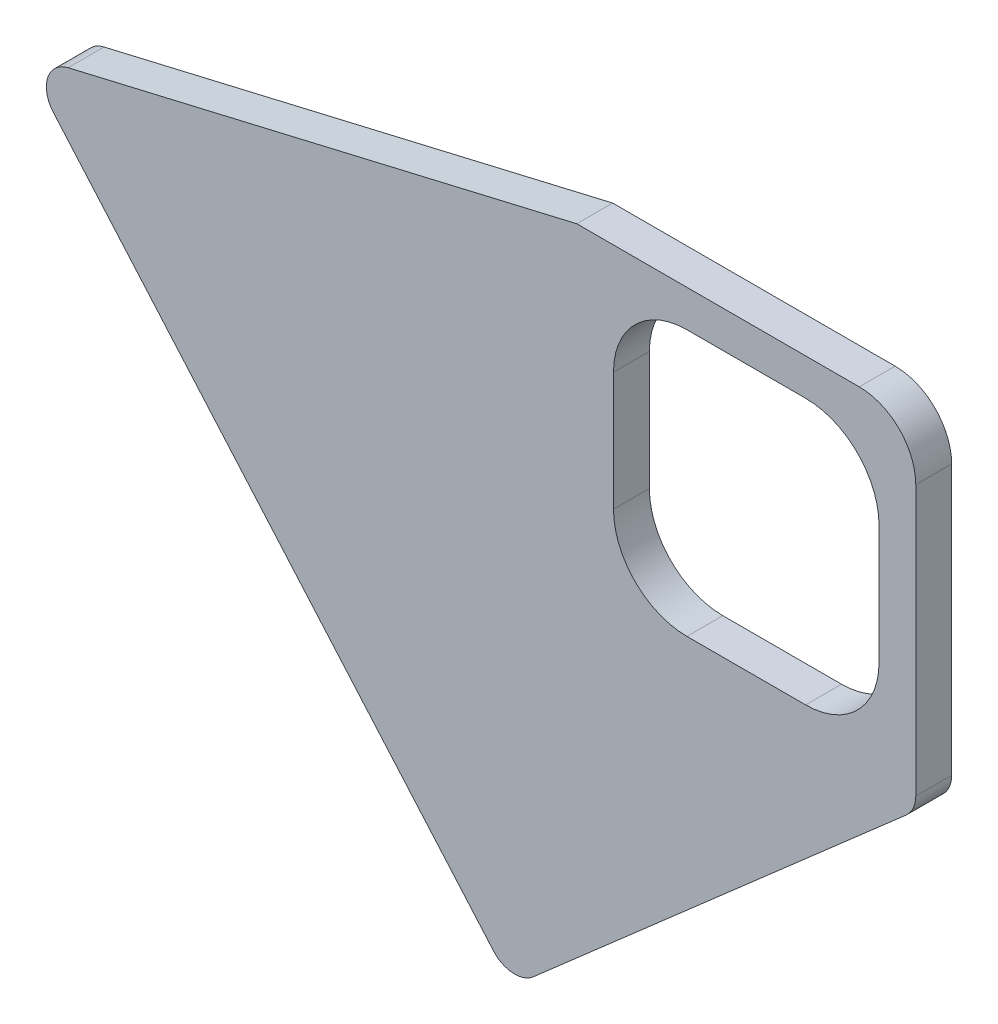
ISO-10303-21;
HEADER;
FILE_DESCRIPTION(('STEP AP214'),'2;1');
FILE_NAME('part.step','',(''),(''),'','','');
FILE_SCHEMA(('AUTOMOTIVE_DESIGN { 1 0 10303 214 1 1 1 1 }'));
ENDSEC;
DATA;
#1=APPLICATION_CONTEXT('core data for automotive mechanical design processes');
#2=APPLICATION_PROTOCOL_DEFINITION('international standard','automotive_design',2000,#1);
#3=PRODUCT_CONTEXT('',#1,'mechanical');
#4=PRODUCT('Part','Part','',(#3));
#5=PRODUCT_RELATED_PRODUCT_CATEGORY('part','',(#4));
#6=PRODUCT_DEFINITION_FORMATION('','',#4);
#7=PRODUCT_DEFINITION_CONTEXT('part definition',#1,'design');
#8=PRODUCT_DEFINITION('design','',#6,#7);
#9=PRODUCT_DEFINITION_SHAPE('','',#8);
#10=(LENGTH_UNIT() NAMED_UNIT(*) SI_UNIT(.MILLI.,.METRE.));
#11=(NAMED_UNIT(*) PLANE_ANGLE_UNIT() SI_UNIT($,.RADIAN.));
#12=(NAMED_UNIT(*) SI_UNIT($,.STERADIAN.) SOLID_ANGLE_UNIT());
#13=UNCERTAINTY_MEASURE_WITH_UNIT(LENGTH_MEASURE(1.E-05),#10,'distance_accuracy_value','');
#14=(GEOMETRIC_REPRESENTATION_CONTEXT(3) GLOBAL_UNCERTAINTY_ASSIGNED_CONTEXT((#13)) GLOBAL_UNIT_ASSIGNED_CONTEXT((#10,
#11,#12)) REPRESENTATION_CONTEXT('',''));
#15=CARTESIAN_POINT('',(0.,0.,0.));
#16=DIRECTION('',(0.,0.,1.));
#17=DIRECTION('',(1.,0.,0.));
#18=AXIS2_PLACEMENT_3D('',#15,#16,#17);
#19=CARTESIAN_POINT('',(-41.4714420605064,-92.5846064922651,6.35));
#20=DIRECTION('',(-0.658785331497527,0.752330969057963,0.));
#21=DIRECTION('',(-0.752330969057963,-0.658785331497527,0.));
#22=AXIS2_PLACEMENT_3D('',#19,#20,#21);
#23=PLANE('',#22);
#24=DIRECTION('',(0.752330969057963,0.658785331497527,0.));
#25=VECTOR('',#24,1.);
#26=CARTESIAN_POINT('',(-41.4714420605064,-92.5846064922651,6.35));
#27=LINE('',#26,#25);
#28=CARTESIAN_POINT('',(-37.6971197494054,-89.2795874552172,6.35));
#29=VERTEX_POINT('',#28);
#30=CARTESIAN_POINT('',(28.2939266574876,-31.4939383578925,6.35));
#31=VERTEX_POINT('',#30);
#32=EDGE_CURVE('E221',#29,#31,#27,.T.);
#33=ORIENTED_EDGE('',*,*,#32,.F.);
#34=DIRECTION('',(0.,0.,-1.));
#35=VECTOR('',#34,1.);
#36=CARTESIAN_POINT('',(-37.6971197494054,-89.2795874552172,6.35));
#37=LINE('',#36,#35);
#38=CARTESIAN_POINT('',(-37.6971197494054,-89.2795874552172,0.));
#39=VERTEX_POINT('',#38);
#40=EDGE_CURVE('E41',#29,#39,#37,.T.);
#41=ORIENTED_EDGE('',*,*,#40,.T.);
#42=DIRECTION('',(0.752330969057963,0.658785331497527,0.));
#43=VECTOR('',#42,1.);
#44=CARTESIAN_POINT('',(-41.4714420605064,-92.5846064922651,0.));
#45=LINE('',#44,#43);
#46=CARTESIAN_POINT('',(28.2939266574876,-31.4939383578925,0.));
#47=VERTEX_POINT('',#46);
#48=EDGE_CURVE('E209',#39,#47,#45,.T.);
#49=ORIENTED_EDGE('',*,*,#48,.T.);
#50=DIRECTION('',(0.,0.,-1.));
#51=VECTOR('',#50,1.);
#52=CARTESIAN_POINT('',(28.2939266574876,-31.4939383578925,6.35));
#53=LINE('',#52,#51);
#54=EDGE_CURVE('E279',#47,#31,#53,.F.);
#55=ORIENTED_EDGE('',*,*,#54,.T.);
#56=EDGE_LOOP('',(#33,#41,#49,#55));
#57=FACE_BOUND('',#56,.T.);
#58=ADVANCED_FACE('F33',(#57),#23,.F.);
#59=CARTESIAN_POINT('',(30.,30.,6.35));
#60=DIRECTION('',(-1.,0.,0.));
#61=DIRECTION('',(0.,-1.,0.));
#62=AXIS2_PLACEMENT_3D('',#59,#60,#61);
#63=PLANE('',#62);
#64=DIRECTION('',(0.,1.,0.));
#65=VECTOR('',#64,1.);
#66=CARTESIAN_POINT('',(30.,30.,6.35));
#67=LINE('',#66,#65);
#68=CARTESIAN_POINT('',(30.,-27.7322835126027,6.35));
#69=VERTEX_POINT('',#68);
#70=CARTESIAN_POINT('',(30.,20.,6.35));
#71=VERTEX_POINT('',#70);
#72=EDGE_CURVE('E224',#69,#71,#67,.T.);
#73=ORIENTED_EDGE('',*,*,#72,.F.);
#74=DIRECTION('',(0.,0.,-1.));
#75=VECTOR('',#74,1.);
#76=CARTESIAN_POINT('',(30.,-27.7322835126027,6.35));
#77=LINE('',#76,#75);
#78=CARTESIAN_POINT('',(30.,-27.7322835126027,0.));
#79=VERTEX_POINT('',#78);
#80=EDGE_CURVE('E11',#69,#79,#77,.T.);
#81=ORIENTED_EDGE('',*,*,#80,.T.);
#82=DIRECTION('',(0.,1.,0.));
#83=VECTOR('',#82,1.);
#84=CARTESIAN_POINT('',(30.,30.,0.));
#85=LINE('',#84,#83);
#86=CARTESIAN_POINT('',(30.,20.,0.));
#87=VERTEX_POINT('',#86);
#88=EDGE_CURVE('E238',#79,#87,#85,.T.);
#89=ORIENTED_EDGE('',*,*,#88,.T.);
#90=DIRECTION('',(0.,0.,-1.));
#91=VECTOR('',#90,1.);
#92=CARTESIAN_POINT('',(30.,20.,6.35));
#93=LINE('',#92,#91);
#94=EDGE_CURVE('E255',#87,#71,#93,.F.);
#95=ORIENTED_EDGE('',*,*,#94,.T.);
#96=EDGE_LOOP('',(#73,#81,#89,#95));
#97=FACE_BOUND('',#96,.T.);
#98=ADVANCED_FACE('F295',(#97),#63,.F.);
#99=CARTESIAN_POINT('',(-30.,30.,6.35));
#100=DIRECTION('',(0.,-1.,0.));
#101=DIRECTION('',(0.,0.,-1.));
#102=AXIS2_PLACEMENT_3D('',#99,#100,#101);
#103=PLANE('',#102);
#104=DIRECTION('',(-1.,0.,0.));
#105=VECTOR('',#104,1.);
#106=CARTESIAN_POINT('',(-30.,30.,6.35));
#107=LINE('',#106,#105);
#108=CARTESIAN_POINT('',(20.,30.,6.35));
#109=VERTEX_POINT('',#108);
#110=CARTESIAN_POINT('',(-30.,30.,6.35));
#111=VERTEX_POINT('',#110);
#112=EDGE_CURVE('E227',#109,#111,#107,.T.);
#113=ORIENTED_EDGE('',*,*,#112,.F.);
#114=DIRECTION('',(0.,0.,-1.));
#115=VECTOR('',#114,1.);
#116=CARTESIAN_POINT('',(20.,30.,6.35));
#117=LINE('',#116,#115);
#118=CARTESIAN_POINT('',(20.,30.,0.));
#119=VERTEX_POINT('',#118);
#120=EDGE_CURVE('E249',#109,#119,#117,.T.);
#121=ORIENTED_EDGE('',*,*,#120,.T.);
#122=DIRECTION('',(-1.,0.,0.));
#123=VECTOR('',#122,1.);
#124=CARTESIAN_POINT('',(-30.,30.,0.));
#125=LINE('',#124,#123);
#126=CARTESIAN_POINT('',(-30.,30.,0.));
#127=VERTEX_POINT('',#126);
#128=EDGE_CURVE('E240',#119,#127,#125,.T.);
#129=ORIENTED_EDGE('',*,*,#128,.T.);
#130=DIRECTION('',(0.,0.,-1.));
#131=VECTOR('',#130,1.);
#132=CARTESIAN_POINT('',(-30.,30.,6.35));
#133=LINE('',#132,#131);
#134=EDGE_CURVE('E235',#111,#127,#133,.T.);
#135=ORIENTED_EDGE('',*,*,#134,.F.);
#136=EDGE_LOOP('',(#113,#121,#129,#135));
#137=FACE_BOUND('',#136,.T.);
#138=ADVANCED_FACE('F319',(#137),#103,.F.);
#139=CARTESIAN_POINT('',(-128.096756389888,7.01486598292345,6.35));
#140=DIRECTION('',(0.228132112939672,-0.973630185977038,0.));
#141=DIRECTION('',(0.973630185977038,0.228132112939672,0.));
#142=AXIS2_PLACEMENT_3D('',#139,#140,#141);
#143=PLANE('',#142);
#144=DIRECTION('',(-0.973630185977038,-0.228132112939672,0.));
#145=VECTOR('',#144,1.);
#146=CARTESIAN_POINT('',(-128.096756389888,7.01486598292345,0.));
#147=LINE('',#146,#145);
#148=CARTESIAN_POINT('',(-120.022341274958,8.90678902254509,0.));
#149=VERTEX_POINT('',#148);
#150=EDGE_CURVE('E242',#127,#149,#147,.T.);
#151=ORIENTED_EDGE('',*,*,#150,.T.);
#152=DIRECTION('',(0.,0.,-1.));
#153=VECTOR('',#152,1.);
#154=CARTESIAN_POINT('',(-120.022341274958,8.90678902254509,6.35));
#155=LINE('',#154,#153);
#156=CARTESIAN_POINT('',(-120.022341274958,8.90678902254509,6.35));
#157=VERTEX_POINT('',#156);
#158=EDGE_CURVE('E271',#149,#157,#155,.F.);
#159=ORIENTED_EDGE('',*,*,#158,.T.);
#160=DIRECTION('',(-0.973630185977038,-0.228132112939672,0.));
#161=VECTOR('',#160,1.);
#162=CARTESIAN_POINT('',(-128.096756389888,7.01486598292345,6.35));
#163=LINE('',#162,#161);
#164=EDGE_CURVE('E229',#111,#157,#163,.T.);
#165=ORIENTED_EDGE('',*,*,#164,.F.);
#166=ORIENTED_EDGE('',*,*,#134,.T.);
#167=EDGE_LOOP('',(#151,#159,#165,#166));
#168=FACE_BOUND('',#167,.T.);
#169=ADVANCED_FACE('F312',(#168),#143,.F.);
#170=CARTESIAN_POINT('',(-128.096756389888,7.01486598292345,6.35));
#171=DIRECTION('',(0.754541458145368,0.656252381283194,0.));
#172=DIRECTION('',(-0.656252381283194,0.754541458145368,0.));
#173=AXIS2_PLACEMENT_3D('',#170,#171,#172);
#174=PLANE('',#173);
#175=DIRECTION('',(0.656252381283194,-0.754541458145368,0.));
#176=VECTOR('',#175,1.);
#177=CARTESIAN_POINT('',(-128.096756389888,7.01486598292345,6.35));
#178=LINE('',#177,#176);
#179=CARTESIAN_POINT('',(-122.654388000986,0.757376186243932,6.35));
#180=VERTEX_POINT('',#179);
#181=CARTESIAN_POINT('',(-44.7637536976198,-88.7991945163434,6.35));
#182=VERTEX_POINT('',#181);
#183=EDGE_CURVE('E232',#180,#182,#178,.T.);
#184=ORIENTED_EDGE('',*,*,#183,.F.);
#185=DIRECTION('',(0.,0.,-1.));
#186=VECTOR('',#185,1.);
#187=CARTESIAN_POINT('',(-122.654388000986,0.757376186243936,6.35));
#188=LINE('',#187,#186);
#189=CARTESIAN_POINT('',(-122.654388000986,0.757376186243932,0.));
#190=VERTEX_POINT('',#189);
#191=EDGE_CURVE('E262',#180,#190,#188,.T.);
#192=ORIENTED_EDGE('',*,*,#191,.T.);
#193=DIRECTION('',(0.656252381283194,-0.754541458145368,0.));
#194=VECTOR('',#193,1.);
#195=CARTESIAN_POINT('',(-128.096756389888,7.01486598292345,0.));
#196=LINE('',#195,#194);
#197=CARTESIAN_POINT('',(-44.7637536976198,-88.7991945163434,0.));
#198=VERTEX_POINT('',#197);
#199=EDGE_CURVE('E225',#190,#198,#196,.T.);
#200=ORIENTED_EDGE('',*,*,#199,.T.);
#201=DIRECTION('',(0.,0.,-1.));
#202=VECTOR('',#201,1.);
#203=CARTESIAN_POINT('',(-44.7637536976198,-88.7991945163434,6.35));
#204=LINE('',#203,#202);
#205=EDGE_CURVE('E260',#198,#182,#204,.F.);
#206=ORIENTED_EDGE('',*,*,#205,.T.);
#207=EDGE_LOOP('',(#184,#192,#200,#206));
#208=FACE_BOUND('',#207,.T.);
#209=ADVANCED_FACE('F305',(#208),#174,.F.);
#210=CARTESIAN_POINT('',(0.,0.,6.35));
#211=DIRECTION('',(0.,0.,-1.));
#212=DIRECTION('',(-1.,0.,0.));
#213=AXIS2_PLACEMENT_3D('',#210,#211,#212);
#214=PLANE('',#213);
#215=DIRECTION('',(0.,1.,0.));
#216=VECTOR('',#215,1.);
#217=CARTESIAN_POINT('',(23.5,10.5,6.35));
#218=LINE('',#217,#216);
#219=CARTESIAN_POINT('',(23.5,-10.5,6.35));
#220=VERTEX_POINT('',#219);
#221=CARTESIAN_POINT('',(23.5,10.5,6.35));
#222=VERTEX_POINT('',#221);
#223=EDGE_CURVE('E191',#220,#222,#218,.T.);
#224=ORIENTED_EDGE('',*,*,#223,.F.);
#225=CARTESIAN_POINT('',(10.5,-10.5,6.35));
#226=DIRECTION('',(0.,0.,1.));
#227=DIRECTION('',(1.,0.,0.));
#228=AXIS2_PLACEMENT_3D('',#225,#226,#227);
#229=CIRCLE('',#228,13.);
#230=CARTESIAN_POINT('',(10.5,-23.5,6.35));
#231=VERTEX_POINT('',#230);
#232=EDGE_CURVE('E48',#231,#220,#229,.T.);
#233=ORIENTED_EDGE('',*,*,#232,.F.);
#234=DIRECTION('',(1.,0.,0.));
#235=VECTOR('',#234,1.);
#236=CARTESIAN_POINT('',(-10.5,-23.5,6.35));
#237=LINE('',#236,#235);
#238=CARTESIAN_POINT('',(-10.5,-23.5,6.35));
#239=VERTEX_POINT('',#238);
#240=EDGE_CURVE('E171',#239,#231,#237,.T.);
#241=ORIENTED_EDGE('',*,*,#240,.F.);
#242=CARTESIAN_POINT('',(-10.5,-10.5,6.35));
#243=DIRECTION('',(0.,0.,1.));
#244=DIRECTION('',(1.,0.,0.));
#245=AXIS2_PLACEMENT_3D('',#242,#243,#244);
#246=CIRCLE('',#245,13.);
#247=CARTESIAN_POINT('',(-23.5,-10.5,6.35));
#248=VERTEX_POINT('',#247);
#249=EDGE_CURVE('E174',#248,#239,#246,.T.);
#250=ORIENTED_EDGE('',*,*,#249,.F.);
#251=DIRECTION('',(0.,-1.,0.));
#252=VECTOR('',#251,1.);
#253=CARTESIAN_POINT('',(-23.5,10.5,6.35));
#254=LINE('',#253,#252);
#255=CARTESIAN_POINT('',(-23.5,10.5,6.35));
#256=VERTEX_POINT('',#255);
#257=EDGE_CURVE('E202',#256,#248,#254,.T.);
#258=ORIENTED_EDGE('',*,*,#257,.F.);
#259=CARTESIAN_POINT('',(-10.5,10.5,6.35));
#260=DIRECTION('',(0.,0.,1.));
#261=DIRECTION('',(1.,0.,0.));
#262=AXIS2_PLACEMENT_3D('',#259,#260,#261);
#263=CIRCLE('',#262,13.);
#264=CARTESIAN_POINT('',(-10.5,23.5,6.35));
#265=VERTEX_POINT('',#264);
#266=EDGE_CURVE('E199',#265,#256,#263,.T.);
#267=ORIENTED_EDGE('',*,*,#266,.F.);
#268=DIRECTION('',(-1.,0.,0.));
#269=VECTOR('',#268,1.);
#270=CARTESIAN_POINT('',(-10.5,23.5,6.35));
#271=LINE('',#270,#269);
#272=CARTESIAN_POINT('',(10.5,23.5,6.35));
#273=VERTEX_POINT('',#272);
#274=EDGE_CURVE('E196',#273,#265,#271,.T.);
#275=ORIENTED_EDGE('',*,*,#274,.F.);
#276=CARTESIAN_POINT('',(10.5,10.5,6.35));
#277=DIRECTION('',(0.,0.,1.));
#278=DIRECTION('',(-1.,0.,0.));
#279=AXIS2_PLACEMENT_3D('',#276,#277,#278);
#280=CIRCLE('',#279,13.);
#281=EDGE_CURVE('E193',#222,#273,#280,.T.);
#282=ORIENTED_EDGE('',*,*,#281,.F.);
#283=EDGE_LOOP('',(#224,#233,#241,#250,#258,#267,#275,#282));
#284=FACE_BOUND('',#283,.T.);
#285=ORIENTED_EDGE('',*,*,#164,.T.);
#286=CARTESIAN_POINT('',(-118.881680710259,4.03863809265991,6.35));
#287=DIRECTION('',(0.,0.,-1.));
#288=DIRECTION('',(-1.,0.,0.));
#289=AXIS2_PLACEMENT_3D('',#286,#287,#288);
#290=CIRCLE('',#289,5.);
#291=EDGE_CURVE('E277',#157,#180,#290,.F.);
#292=ORIENTED_EDGE('',*,*,#291,.T.);
#293=ORIENTED_EDGE('',*,*,#183,.T.);
#294=CARTESIAN_POINT('',(-40.991046406893,-85.5179326099274,6.35));
#295=DIRECTION('',(0.,0.,-1.));
#296=DIRECTION('',(-1.,0.,0.));
#297=AXIS2_PLACEMENT_3D('',#294,#295,#296);
#298=CIRCLE('',#297,5.);
#299=EDGE_CURVE('E275',#182,#29,#298,.F.);
#300=ORIENTED_EDGE('',*,*,#299,.T.);
#301=ORIENTED_EDGE('',*,*,#32,.T.);
#302=CARTESIAN_POINT('',(25.,-27.7322835126027,6.35));
#303=DIRECTION('',(0.,0.,-1.));
#304=DIRECTION('',(-1.,0.,0.));
#305=AXIS2_PLACEMENT_3D('',#302,#303,#304);
#306=CIRCLE('',#305,5.);
#307=EDGE_CURVE('E273',#31,#69,#306,.F.);
#308=ORIENTED_EDGE('',*,*,#307,.T.);
#309=ORIENTED_EDGE('',*,*,#72,.T.);
#310=CARTESIAN_POINT('',(20.,20.,6.35));
#311=DIRECTION('',(0.,0.,-1.));
#312=DIRECTION('',(-1.,0.,0.));
#313=AXIS2_PLACEMENT_3D('',#310,#311,#312);
#314=CIRCLE('',#313,10.);
#315=EDGE_CURVE('E258',#71,#109,#314,.F.);
#316=ORIENTED_EDGE('',*,*,#315,.T.);
#317=ORIENTED_EDGE('',*,*,#112,.T.);
#318=EDGE_LOOP('',(#285,#292,#293,#300,#301,#308,#309,#316,#317));
#319=FACE_BOUND('',#318,.T.);
#320=ADVANCED_FACE('F299',(#284,#319),#214,.F.);
#321=CARTESIAN_POINT('',(0.,0.,0.));
#322=DIRECTION('',(0.,0.,-1.));
#323=DIRECTION('',(-1.,0.,0.));
#324=AXIS2_PLACEMENT_3D('',#321,#322,#323);
#325=PLANE('',#324);
#326=CARTESIAN_POINT('',(10.5,-10.5,0.));
#327=DIRECTION('',(0.,0.,1.));
#328=DIRECTION('',(1.,0.,0.));
#329=AXIS2_PLACEMENT_3D('',#326,#327,#328);
#330=CIRCLE('',#329,13.);
#331=CARTESIAN_POINT('',(10.5,-23.5,0.));
#332=VERTEX_POINT('',#331);
#333=CARTESIAN_POINT('',(23.5,-10.5,0.));
#334=VERTEX_POINT('',#333);
#335=EDGE_CURVE('E154',#332,#334,#330,.T.);
#336=ORIENTED_EDGE('',*,*,#335,.T.);
#337=DIRECTION('',(0.,1.,0.));
#338=VECTOR('',#337,1.);
#339=CARTESIAN_POINT('',(23.5,10.5,0.));
#340=LINE('',#339,#338);
#341=CARTESIAN_POINT('',(23.5,10.5,0.));
#342=VERTEX_POINT('',#341);
#343=EDGE_CURVE('E163',#334,#342,#340,.T.);
#344=ORIENTED_EDGE('',*,*,#343,.T.);
#345=CARTESIAN_POINT('',(10.5,10.5,0.));
#346=DIRECTION('',(0.,0.,1.));
#347=DIRECTION('',(-1.,0.,0.));
#348=AXIS2_PLACEMENT_3D('',#345,#346,#347);
#349=CIRCLE('',#348,13.);
#350=CARTESIAN_POINT('',(10.5,23.5,0.));
#351=VERTEX_POINT('',#350);
#352=EDGE_CURVE('E56',#342,#351,#349,.T.);
#353=ORIENTED_EDGE('',*,*,#352,.T.);
#354=DIRECTION('',(-1.,0.,0.));
#355=VECTOR('',#354,1.);
#356=CARTESIAN_POINT('',(-10.5,23.5,0.));
#357=LINE('',#356,#355);
#358=CARTESIAN_POINT('',(-10.5,23.5,0.));
#359=VERTEX_POINT('',#358);
#360=EDGE_CURVE('E178',#351,#359,#357,.T.);
#361=ORIENTED_EDGE('',*,*,#360,.T.);
#362=CARTESIAN_POINT('',(-10.5,10.5,0.));
#363=DIRECTION('',(0.,0.,1.));
#364=DIRECTION('',(1.,0.,0.));
#365=AXIS2_PLACEMENT_3D('',#362,#363,#364);
#366=CIRCLE('',#365,13.);
#367=CARTESIAN_POINT('',(-23.5,10.5,0.));
#368=VERTEX_POINT('',#367);
#369=EDGE_CURVE('E181',#359,#368,#366,.T.);
#370=ORIENTED_EDGE('',*,*,#369,.T.);
#371=DIRECTION('',(0.,-1.,0.));
#372=VECTOR('',#371,1.);
#373=CARTESIAN_POINT('',(-23.5,10.5,0.));
#374=LINE('',#373,#372);
#375=CARTESIAN_POINT('',(-23.5,-10.5,0.));
#376=VERTEX_POINT('',#375);
#377=EDGE_CURVE('E184',#368,#376,#374,.T.);
#378=ORIENTED_EDGE('',*,*,#377,.T.);
#379=CARTESIAN_POINT('',(-10.5,-10.5,0.));
#380=DIRECTION('',(0.,0.,1.));
#381=DIRECTION('',(1.,0.,0.));
#382=AXIS2_PLACEMENT_3D('',#379,#380,#381);
#383=CIRCLE('',#382,13.);
#384=CARTESIAN_POINT('',(-10.5,-23.5,0.));
#385=VERTEX_POINT('',#384);
#386=EDGE_CURVE('E187',#376,#385,#383,.T.);
#387=ORIENTED_EDGE('',*,*,#386,.T.);
#388=DIRECTION('',(1.,0.,0.));
#389=VECTOR('',#388,1.);
#390=CARTESIAN_POINT('',(-10.5,-23.5,0.));
#391=LINE('',#390,#389);
#392=EDGE_CURVE('E160',#385,#332,#391,.T.);
#393=ORIENTED_EDGE('',*,*,#392,.T.);
#394=EDGE_LOOP('',(#336,#344,#353,#361,#370,#378,#387,#393));
#395=FACE_BOUND('',#394,.T.);
#396=ORIENTED_EDGE('',*,*,#199,.F.);
#397=CARTESIAN_POINT('',(-118.881680710259,4.03863809265991,0.));
#398=DIRECTION('',(0.,0.,-1.));
#399=DIRECTION('',(-1.,0.,0.));
#400=AXIS2_PLACEMENT_3D('',#397,#398,#399);
#401=CIRCLE('',#400,5.);
#402=EDGE_CURVE('E269',#190,#149,#401,.T.);
#403=ORIENTED_EDGE('',*,*,#402,.T.);
#404=ORIENTED_EDGE('',*,*,#150,.F.);
#405=ORIENTED_EDGE('',*,*,#128,.F.);
#406=CARTESIAN_POINT('',(20.,20.,0.));
#407=DIRECTION('',(0.,0.,-1.));
#408=DIRECTION('',(-1.,0.,0.));
#409=AXIS2_PLACEMENT_3D('',#406,#407,#408);
#410=CIRCLE('',#409,10.);
#411=EDGE_CURVE('E252',#119,#87,#410,.T.);
#412=ORIENTED_EDGE('',*,*,#411,.T.);
#413=ORIENTED_EDGE('',*,*,#88,.F.);
#414=CARTESIAN_POINT('',(25.,-27.7322835126027,0.));
#415=DIRECTION('',(0.,0.,-1.));
#416=DIRECTION('',(-1.,0.,0.));
#417=AXIS2_PLACEMENT_3D('',#414,#415,#416);
#418=CIRCLE('',#417,5.);
#419=EDGE_CURVE('E265',#79,#47,#418,.T.);
#420=ORIENTED_EDGE('',*,*,#419,.T.);
#421=ORIENTED_EDGE('',*,*,#48,.F.);
#422=CARTESIAN_POINT('',(-40.991046406893,-85.5179326099274,0.));
#423=DIRECTION('',(0.,0.,-1.));
#424=DIRECTION('',(-1.,0.,0.));
#425=AXIS2_PLACEMENT_3D('',#422,#423,#424);
#426=CIRCLE('',#425,5.);
#427=EDGE_CURVE('E267',#39,#198,#426,.T.);
#428=ORIENTED_EDGE('',*,*,#427,.T.);
#429=EDGE_LOOP('',(#396,#403,#404,#405,#412,#413,#420,#421,#428));
#430=FACE_BOUND('',#429,.T.);
#431=ADVANCED_FACE('F167',(#395,#430),#325,.T.);
#432=CARTESIAN_POINT('',(20.,20.,6.35));
#433=DIRECTION('',(0.,0.,-1.));
#434=DIRECTION('',(-1.,0.,0.));
#435=AXIS2_PLACEMENT_3D('',#432,#433,#434);
#436=CYLINDRICAL_SURFACE('',#435,10.);
#437=ORIENTED_EDGE('',*,*,#315,.F.);
#438=ORIENTED_EDGE('',*,*,#94,.F.);
#439=ORIENTED_EDGE('',*,*,#411,.F.);
#440=ORIENTED_EDGE('',*,*,#120,.F.);
#441=EDGE_LOOP('',(#437,#438,#439,#440));
#442=FACE_BOUND('',#441,.T.);
#443=ADVANCED_FACE('F321',(#442),#436,.T.);
#444=CARTESIAN_POINT('',(-118.881680710259,4.03863809265991,6.35));
#445=DIRECTION('',(0.,0.,-1.));
#446=DIRECTION('',(-1.,0.,0.));
#447=AXIS2_PLACEMENT_3D('',#444,#445,#446);
#448=CYLINDRICAL_SURFACE('',#447,5.);
#449=ORIENTED_EDGE('',*,*,#291,.F.);
#450=ORIENTED_EDGE('',*,*,#158,.F.);
#451=ORIENTED_EDGE('',*,*,#402,.F.);
#452=ORIENTED_EDGE('',*,*,#191,.F.);
#453=EDGE_LOOP('',(#449,#450,#451,#452));
#454=FACE_BOUND('',#453,.T.);
#455=ADVANCED_FACE('F316',(#454),#448,.T.);
#456=CARTESIAN_POINT('',(-40.991046406893,-85.5179326099274,6.35));
#457=DIRECTION('',(0.,0.,-1.));
#458=DIRECTION('',(-1.,0.,0.));
#459=AXIS2_PLACEMENT_3D('',#456,#457,#458);
#460=CYLINDRICAL_SURFACE('',#459,5.);
#461=ORIENTED_EDGE('',*,*,#299,.F.);
#462=ORIENTED_EDGE('',*,*,#205,.F.);
#463=ORIENTED_EDGE('',*,*,#427,.F.);
#464=ORIENTED_EDGE('',*,*,#40,.F.);
#465=EDGE_LOOP('',(#461,#462,#463,#464));
#466=FACE_BOUND('',#465,.T.);
#467=ADVANCED_FACE('F303',(#466),#460,.T.);
#468=CARTESIAN_POINT('',(25.,-27.7322835126027,6.35));
#469=DIRECTION('',(0.,0.,-1.));
#470=DIRECTION('',(-1.,0.,0.));
#471=AXIS2_PLACEMENT_3D('',#468,#469,#470);
#472=CYLINDRICAL_SURFACE('',#471,5.);
#473=ORIENTED_EDGE('',*,*,#307,.F.);
#474=ORIENTED_EDGE('',*,*,#54,.F.);
#475=ORIENTED_EDGE('',*,*,#419,.F.);
#476=ORIENTED_EDGE('',*,*,#80,.F.);
#477=EDGE_LOOP('',(#473,#474,#475,#476));
#478=FACE_BOUND('',#477,.T.);
#479=ADVANCED_FACE('F35',(#478),#472,.T.);
#480=CARTESIAN_POINT('',(10.5,-10.5,0.));
#481=DIRECTION('',(0.,0.,1.));
#482=DIRECTION('',(1.,0.,0.));
#483=AXIS2_PLACEMENT_3D('',#480,#481,#482);
#484=CYLINDRICAL_SURFACE('',#483,13.);
#485=ORIENTED_EDGE('',*,*,#232,.T.);
#486=DIRECTION('',(0.,0.,1.));
#487=VECTOR('',#486,1.);
#488=CARTESIAN_POINT('',(23.5,-10.5,0.));
#489=LINE('',#488,#487);
#490=EDGE_CURVE('E150',#334,#220,#489,.T.);
#491=ORIENTED_EDGE('',*,*,#490,.F.);
#492=ORIENTED_EDGE('',*,*,#335,.F.);
#493=DIRECTION('',(0.,0.,1.));
#494=VECTOR('',#493,1.);
#495=CARTESIAN_POINT('',(10.5,-23.5,0.));
#496=LINE('',#495,#494);
#497=EDGE_CURVE('E207',#332,#231,#496,.T.);
#498=ORIENTED_EDGE('',*,*,#497,.T.);
#499=EDGE_LOOP('',(#485,#491,#492,#498));
#500=FACE_BOUND('',#499,.T.);
#501=ADVANCED_FACE('F152',(#500),#484,.F.);
#502=CARTESIAN_POINT('',(-10.5,-23.5,0.));
#503=DIRECTION('',(0.,-1.,0.));
#504=DIRECTION('',(1.,0.,0.));
#505=AXIS2_PLACEMENT_3D('',#502,#503,#504);
#506=PLANE('',#505);
#507=ORIENTED_EDGE('',*,*,#240,.T.);
#508=ORIENTED_EDGE('',*,*,#497,.F.);
#509=ORIENTED_EDGE('',*,*,#392,.F.);
#510=DIRECTION('',(0.,0.,1.));
#511=VECTOR('',#510,1.);
#512=CARTESIAN_POINT('',(-10.5,-23.5,0.));
#513=LINE('',#512,#511);
#514=EDGE_CURVE('E210',#385,#239,#513,.T.);
#515=ORIENTED_EDGE('',*,*,#514,.T.);
#516=EDGE_LOOP('',(#507,#508,#509,#515));
#517=FACE_BOUND('',#516,.T.);
#518=ADVANCED_FACE('F348',(#517),#506,.F.);
#519=CARTESIAN_POINT('',(-10.5,-10.5,0.));
#520=DIRECTION('',(0.,0.,1.));
#521=DIRECTION('',(1.,0.,0.));
#522=AXIS2_PLACEMENT_3D('',#519,#520,#521);
#523=CYLINDRICAL_SURFACE('',#522,13.);
#524=ORIENTED_EDGE('',*,*,#249,.T.);
#525=ORIENTED_EDGE('',*,*,#514,.F.);
#526=ORIENTED_EDGE('',*,*,#386,.F.);
#527=DIRECTION('',(0.,0.,1.));
#528=VECTOR('',#527,1.);
#529=CARTESIAN_POINT('',(-23.5,-10.5,0.));
#530=LINE('',#529,#528);
#531=EDGE_CURVE('E212',#376,#248,#530,.T.);
#532=ORIENTED_EDGE('',*,*,#531,.T.);
#533=EDGE_LOOP('',(#524,#525,#526,#532));
#534=FACE_BOUND('',#533,.T.);
#535=ADVANCED_FACE('F365',(#534),#523,.F.);
#536=CARTESIAN_POINT('',(-23.5,10.5,0.));
#537=DIRECTION('',(-1.,0.,0.));
#538=DIRECTION('',(0.,-1.,0.));
#539=AXIS2_PLACEMENT_3D('',#536,#537,#538);
#540=PLANE('',#539);
#541=ORIENTED_EDGE('',*,*,#257,.T.);
#542=ORIENTED_EDGE('',*,*,#531,.F.);
#543=ORIENTED_EDGE('',*,*,#377,.F.);
#544=DIRECTION('',(0.,0.,1.));
#545=VECTOR('',#544,1.);
#546=CARTESIAN_POINT('',(-23.5,10.5,0.));
#547=LINE('',#546,#545);
#548=EDGE_CURVE('E214',#368,#256,#547,.T.);
#549=ORIENTED_EDGE('',*,*,#548,.T.);
#550=EDGE_LOOP('',(#541,#542,#543,#549));
#551=FACE_BOUND('',#550,.T.);
#552=ADVANCED_FACE('F361',(#551),#540,.F.);
#553=CARTESIAN_POINT('',(-10.5,10.5,0.));
#554=DIRECTION('',(0.,0.,1.));
#555=DIRECTION('',(1.,0.,0.));
#556=AXIS2_PLACEMENT_3D('',#553,#554,#555);
#557=CYLINDRICAL_SURFACE('',#556,13.);
#558=ORIENTED_EDGE('',*,*,#266,.T.);
#559=ORIENTED_EDGE('',*,*,#548,.F.);
#560=ORIENTED_EDGE('',*,*,#369,.F.);
#561=DIRECTION('',(0.,0.,1.));
#562=VECTOR('',#561,1.);
#563=CARTESIAN_POINT('',(-10.5,23.5,0.));
#564=LINE('',#563,#562);
#565=EDGE_CURVE('E216',#359,#265,#564,.T.);
#566=ORIENTED_EDGE('',*,*,#565,.T.);
#567=EDGE_LOOP('',(#558,#559,#560,#566));
#568=FACE_BOUND('',#567,.T.);
#569=ADVANCED_FACE('F357',(#568),#557,.F.);
#570=CARTESIAN_POINT('',(-10.5,23.5,0.));
#571=DIRECTION('',(0.,1.,0.));
#572=DIRECTION('',(-1.,0.,0.));
#573=AXIS2_PLACEMENT_3D('',#570,#571,#572);
#574=PLANE('',#573);
#575=ORIENTED_EDGE('',*,*,#274,.T.);
#576=ORIENTED_EDGE('',*,*,#565,.F.);
#577=ORIENTED_EDGE('',*,*,#360,.F.);
#578=DIRECTION('',(0.,0.,1.));
#579=VECTOR('',#578,1.);
#580=CARTESIAN_POINT('',(10.5,23.5,0.));
#581=LINE('',#580,#579);
#582=EDGE_CURVE('E218',#351,#273,#581,.T.);
#583=ORIENTED_EDGE('',*,*,#582,.T.);
#584=EDGE_LOOP('',(#575,#576,#577,#583));
#585=FACE_BOUND('',#584,.T.);
#586=ADVANCED_FACE('F354',(#585),#574,.F.);
#587=CARTESIAN_POINT('',(10.5,10.5,0.));
#588=DIRECTION('',(0.,0.,1.));
#589=DIRECTION('',(1.,0.,0.));
#590=AXIS2_PLACEMENT_3D('',#587,#588,#589);
#591=CYLINDRICAL_SURFACE('',#590,13.);
#592=ORIENTED_EDGE('',*,*,#281,.T.);
#593=ORIENTED_EDGE('',*,*,#582,.F.);
#594=ORIENTED_EDGE('',*,*,#352,.F.);
#595=DIRECTION('',(0.,0.,1.));
#596=VECTOR('',#595,1.);
#597=CARTESIAN_POINT('',(23.5,10.5,0.));
#598=LINE('',#597,#596);
#599=EDGE_CURVE('E159',#342,#222,#598,.T.);
#600=ORIENTED_EDGE('',*,*,#599,.T.);
#601=EDGE_LOOP('',(#592,#593,#594,#600));
#602=FACE_BOUND('',#601,.T.);
#603=ADVANCED_FACE('F351',(#602),#591,.F.);
#604=CARTESIAN_POINT('',(23.5,10.5,0.));
#605=DIRECTION('',(1.,0.,0.));
#606=DIRECTION('',(0.,1.,0.));
#607=AXIS2_PLACEMENT_3D('',#604,#605,#606);
#608=PLANE('',#607);
#609=ORIENTED_EDGE('',*,*,#223,.T.);
#610=ORIENTED_EDGE('',*,*,#599,.F.);
#611=ORIENTED_EDGE('',*,*,#343,.F.);
#612=ORIENTED_EDGE('',*,*,#490,.T.);
#613=EDGE_LOOP('',(#609,#610,#611,#612));
#614=FACE_BOUND('',#613,.T.);
#615=ADVANCED_FACE('F164',(#614),#608,.F.);
#616=CLOSED_SHELL('',(#58,#98,#138,#169,#209,#320,#431,#443,#455,#467,#479,#501,#518,#535,#552,
#569,#586,#603,#615));
#617=MANIFOLD_SOLID_BREP('B2',#616);
#618=ADVANCED_BREP_SHAPE_REPRESENTATION('',(#18,#617),#14);
#619=SHAPE_DEFINITION_REPRESENTATION(#9,#618);
ENDSEC;
END-ISO-10303-21;
